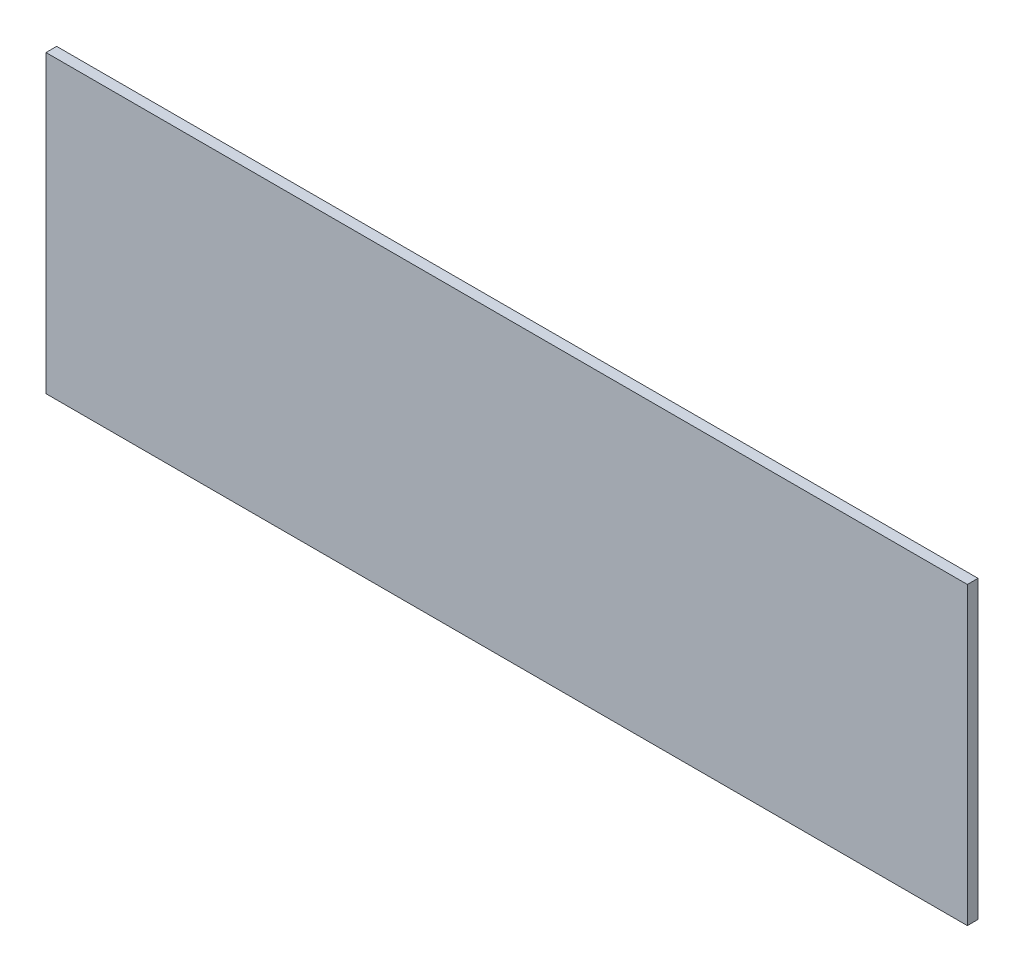
ISO-10303-21;
HEADER;
FILE_DESCRIPTION(('STEP AP214'),'2;1');
FILE_NAME('part.step','',(''),(''),'','','');
FILE_SCHEMA(('AUTOMOTIVE_DESIGN { 1 0 10303 214 1 1 1 1 }'));
ENDSEC;
DATA;
#1=APPLICATION_CONTEXT('core data for automotive mechanical design processes');
#2=APPLICATION_PROTOCOL_DEFINITION('international standard','automotive_design',2000,#1);
#3=PRODUCT_CONTEXT('',#1,'mechanical');
#4=PRODUCT('Part','Part','',(#3));
#5=PRODUCT_RELATED_PRODUCT_CATEGORY('part','',(#4));
#6=PRODUCT_DEFINITION_FORMATION('','',#4);
#7=PRODUCT_DEFINITION_CONTEXT('part definition',#1,'design');
#8=PRODUCT_DEFINITION('design','',#6,#7);
#9=PRODUCT_DEFINITION_SHAPE('','',#8);
#10=(LENGTH_UNIT() NAMED_UNIT(*) SI_UNIT(.MILLI.,.METRE.));
#11=(NAMED_UNIT(*) PLANE_ANGLE_UNIT() SI_UNIT($,.RADIAN.));
#12=(NAMED_UNIT(*) SI_UNIT($,.STERADIAN.) SOLID_ANGLE_UNIT());
#13=UNCERTAINTY_MEASURE_WITH_UNIT(LENGTH_MEASURE(1.E-05),#10,'distance_accuracy_value','');
#14=(GEOMETRIC_REPRESENTATION_CONTEXT(3) GLOBAL_UNCERTAINTY_ASSIGNED_CONTEXT((#13)) GLOBAL_UNIT_ASSIGNED_CONTEXT((#10,
#11,#12)) REPRESENTATION_CONTEXT('',''));
#15=CARTESIAN_POINT('',(0.,0.,0.));
#16=DIRECTION('',(0.,0.,1.));
#17=DIRECTION('',(1.,0.,0.));
#18=AXIS2_PLACEMENT_3D('',#15,#16,#17);
#19=CARTESIAN_POINT('',(831.176734530374,360.,-3.));
#20=DIRECTION('',(-1.,0.,0.));
#21=DIRECTION('',(0.,0.,1.));
#22=AXIS2_PLACEMENT_3D('',#19,#20,#21);
#23=PLANE('',#22);
#24=DIRECTION('',(0.,-1.,0.));
#25=VECTOR('',#24,1.);
#26=CARTESIAN_POINT('',(831.176734530374,360.,0.));
#27=LINE('',#26,#25);
#28=CARTESIAN_POINT('',(831.176734530374,360.,0.));
#29=VERTEX_POINT('',#28);
#30=CARTESIAN_POINT('',(831.176734530374,276.809165979618,0.));
#31=VERTEX_POINT('',#30);
#32=EDGE_CURVE('E99',#29,#31,#27,.T.);
#33=ORIENTED_EDGE('',*,*,#32,.F.);
#34=DIRECTION('',(0.,0.,1.));
#35=VECTOR('',#34,1.);
#36=CARTESIAN_POINT('',(831.176734530374,360.,-3.));
#37=LINE('',#36,#35);
#38=CARTESIAN_POINT('',(831.176734530374,360.,-3.));
#39=VERTEX_POINT('',#38);
#40=EDGE_CURVE('E11',#39,#29,#37,.T.);
#41=ORIENTED_EDGE('',*,*,#40,.F.);
#42=DIRECTION('',(0.,-1.,0.));
#43=VECTOR('',#42,1.);
#44=CARTESIAN_POINT('',(831.176734530374,360.,-3.));
#45=LINE('',#44,#43);
#46=CARTESIAN_POINT('',(831.176734530374,276.809165979618,-3.));
#47=VERTEX_POINT('',#46);
#48=EDGE_CURVE('E93',#39,#47,#45,.T.);
#49=ORIENTED_EDGE('',*,*,#48,.T.);
#50=DIRECTION('',(0.,0.,1.));
#51=VECTOR('',#50,1.);
#52=CARTESIAN_POINT('',(831.176734530374,276.809165979618,-3.));
#53=LINE('',#52,#51);
#54=EDGE_CURVE('E38',#47,#31,#53,.T.);
#55=ORIENTED_EDGE('',*,*,#54,.T.);
#56=EDGE_LOOP('',(#33,#41,#49,#55));
#57=FACE_BOUND('',#56,.T.);
#58=ADVANCED_FACE('F35',(#57),#23,.T.);
#59=CARTESIAN_POINT('',(1090.5748213672,360.,-3.));
#60=DIRECTION('',(0.,1.,0.));
#61=DIRECTION('',(0.,0.,1.));
#62=AXIS2_PLACEMENT_3D('',#59,#60,#61);
#63=PLANE('',#62);
#64=DIRECTION('',(-1.,0.,0.));
#65=VECTOR('',#64,1.);
#66=CARTESIAN_POINT('',(1090.5748213672,360.,0.));
#67=LINE('',#66,#65);
#68=CARTESIAN_POINT('',(1090.5748213672,360.,0.));
#69=VERTEX_POINT('',#68);
#70=EDGE_CURVE('E95',#69,#29,#67,.T.);
#71=ORIENTED_EDGE('',*,*,#70,.F.);
#72=DIRECTION('',(0.,0.,1.));
#73=VECTOR('',#72,1.);
#74=CARTESIAN_POINT('',(1090.5748213672,360.,-3.));
#75=LINE('',#74,#73);
#76=CARTESIAN_POINT('',(1090.5748213672,360.,-3.));
#77=VERTEX_POINT('',#76);
#78=EDGE_CURVE('E44',#77,#69,#75,.T.);
#79=ORIENTED_EDGE('',*,*,#78,.F.);
#80=DIRECTION('',(-1.,0.,0.));
#81=VECTOR('',#80,1.);
#82=CARTESIAN_POINT('',(1090.5748213672,360.,-3.));
#83=LINE('',#82,#81);
#84=EDGE_CURVE('E90',#77,#39,#83,.T.);
#85=ORIENTED_EDGE('',*,*,#84,.T.);
#86=ORIENTED_EDGE('',*,*,#40,.T.);
#87=EDGE_LOOP('',(#71,#79,#85,#86));
#88=FACE_BOUND('',#87,.T.);
#89=ADVANCED_FACE('F109',(#88),#63,.T.);
#90=CARTESIAN_POINT('',(1090.5748213672,276.809165979618,-3.));
#91=DIRECTION('',(1.,0.,0.));
#92=DIRECTION('',(0.,0.,-1.));
#93=AXIS2_PLACEMENT_3D('',#90,#91,#92);
#94=PLANE('',#93);
#95=DIRECTION('',(0.,1.,0.));
#96=VECTOR('',#95,1.);
#97=CARTESIAN_POINT('',(1090.5748213672,276.809165979618,0.));
#98=LINE('',#97,#96);
#99=CARTESIAN_POINT('',(1090.5748213672,276.809165979618,0.));
#100=VERTEX_POINT('',#99);
#101=EDGE_CURVE('E85',#100,#69,#98,.T.);
#102=ORIENTED_EDGE('',*,*,#101,.F.);
#103=DIRECTION('',(0.,0.,1.));
#104=VECTOR('',#103,1.);
#105=CARTESIAN_POINT('',(1090.5748213672,276.809165979618,-3.));
#106=LINE('',#105,#104);
#107=CARTESIAN_POINT('',(1090.5748213672,276.809165979618,-3.));
#108=VERTEX_POINT('',#107);
#109=EDGE_CURVE('E80',#108,#100,#106,.T.);
#110=ORIENTED_EDGE('',*,*,#109,.F.);
#111=DIRECTION('',(0.,1.,0.));
#112=VECTOR('',#111,1.);
#113=CARTESIAN_POINT('',(1090.5748213672,276.809165979618,-3.));
#114=LINE('',#113,#112);
#115=EDGE_CURVE('E83',#108,#77,#114,.T.);
#116=ORIENTED_EDGE('',*,*,#115,.T.);
#117=ORIENTED_EDGE('',*,*,#78,.T.);
#118=EDGE_LOOP('',(#102,#110,#116,#117));
#119=FACE_BOUND('',#118,.T.);
#120=ADVANCED_FACE('F82',(#119),#94,.T.);
#121=CARTESIAN_POINT('',(831.176734530374,276.809165979618,-3.));
#122=DIRECTION('',(0.,-1.,0.));
#123=DIRECTION('',(0.,0.,-1.));
#124=AXIS2_PLACEMENT_3D('',#121,#122,#123);
#125=PLANE('',#124);
#126=DIRECTION('',(1.,0.,0.));
#127=VECTOR('',#126,1.);
#128=CARTESIAN_POINT('',(831.176734530374,276.809165979618,0.));
#129=LINE('',#128,#127);
#130=EDGE_CURVE('E102',#31,#100,#129,.T.);
#131=ORIENTED_EDGE('',*,*,#130,.F.);
#132=ORIENTED_EDGE('',*,*,#54,.F.);
#133=DIRECTION('',(1.,0.,0.));
#134=VECTOR('',#133,1.);
#135=CARTESIAN_POINT('',(831.176734530374,276.809165979618,-3.));
#136=LINE('',#135,#134);
#137=EDGE_CURVE('E89',#47,#108,#136,.T.);
#138=ORIENTED_EDGE('',*,*,#137,.T.);
#139=ORIENTED_EDGE('',*,*,#109,.T.);
#140=EDGE_LOOP('',(#131,#132,#138,#139));
#141=FACE_BOUND('',#140,.T.);
#142=ADVANCED_FACE('F92',(#141),#125,.T.);
#143=CARTESIAN_POINT('',(0.,0.,-3.));
#144=DIRECTION('',(0.,0.,1.));
#145=DIRECTION('',(1.,0.,0.));
#146=AXIS2_PLACEMENT_3D('',#143,#144,#145);
#147=PLANE('',#146);
#148=ORIENTED_EDGE('',*,*,#48,.F.);
#149=ORIENTED_EDGE('',*,*,#84,.F.);
#150=ORIENTED_EDGE('',*,*,#115,.F.);
#151=ORIENTED_EDGE('',*,*,#137,.F.);
#152=EDGE_LOOP('',(#148,#149,#150,#151));
#153=FACE_BOUND('',#152,.T.);
#154=ADVANCED_FACE('F88',(#153),#147,.F.);
#155=CARTESIAN_POINT('',(0.,0.,0.));
#156=DIRECTION('',(0.,0.,1.));
#157=DIRECTION('',(1.,0.,0.));
#158=AXIS2_PLACEMENT_3D('',#155,#156,#157);
#159=PLANE('',#158);
#160=ORIENTED_EDGE('',*,*,#32,.T.);
#161=ORIENTED_EDGE('',*,*,#130,.T.);
#162=ORIENTED_EDGE('',*,*,#101,.T.);
#163=ORIENTED_EDGE('',*,*,#70,.T.);
#164=EDGE_LOOP('',(#160,#161,#162,#163));
#165=FACE_BOUND('',#164,.T.);
#166=ADVANCED_FACE('F108',(#165),#159,.T.);
#167=CLOSED_SHELL('',(#58,#89,#120,#142,#154,#166));
#168=MANIFOLD_SOLID_BREP('B2',#167);
#169=ADVANCED_BREP_SHAPE_REPRESENTATION('',(#18,#168),#14);
#170=SHAPE_DEFINITION_REPRESENTATION(#9,#169);
ENDSEC;
END-ISO-10303-21;
